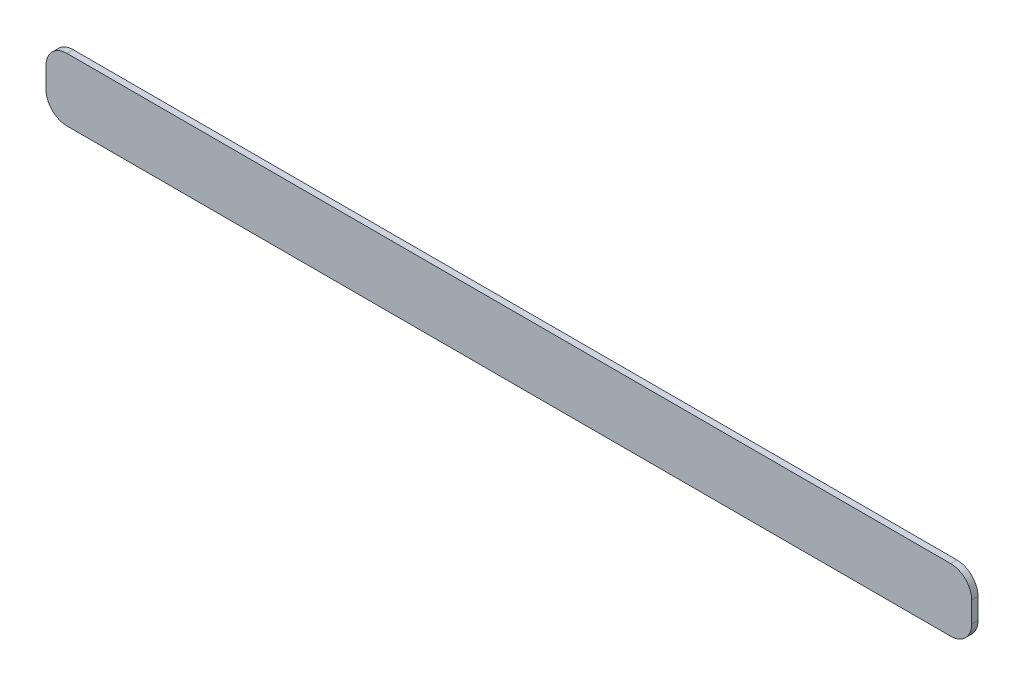
ISO-10303-21;
HEADER;
FILE_DESCRIPTION(('STEP AP214'),'2;1');
FILE_NAME('part.step','',(''),(''),'','','');
FILE_SCHEMA(('AUTOMOTIVE_DESIGN { 1 0 10303 214 1 1 1 1 }'));
ENDSEC;
DATA;
#1=APPLICATION_CONTEXT('core data for automotive mechanical design processes');
#2=APPLICATION_PROTOCOL_DEFINITION('international standard','automotive_design',2000,#1);
#3=PRODUCT_CONTEXT('',#1,'mechanical');
#4=PRODUCT('Part','Part','',(#3));
#5=PRODUCT_RELATED_PRODUCT_CATEGORY('part','',(#4));
#6=PRODUCT_DEFINITION_FORMATION('','',#4);
#7=PRODUCT_DEFINITION_CONTEXT('part definition',#1,'design');
#8=PRODUCT_DEFINITION('design','',#6,#7);
#9=PRODUCT_DEFINITION_SHAPE('','',#8);
#10=(LENGTH_UNIT() NAMED_UNIT(*) SI_UNIT(.MILLI.,.METRE.));
#11=(NAMED_UNIT(*) PLANE_ANGLE_UNIT() SI_UNIT($,.RADIAN.));
#12=(NAMED_UNIT(*) SI_UNIT($,.STERADIAN.) SOLID_ANGLE_UNIT());
#13=UNCERTAINTY_MEASURE_WITH_UNIT(LENGTH_MEASURE(1.E-05),#10,'distance_accuracy_value','');
#14=(GEOMETRIC_REPRESENTATION_CONTEXT(3) GLOBAL_UNCERTAINTY_ASSIGNED_CONTEXT((#13)) GLOBAL_UNIT_ASSIGNED_CONTEXT((#10,
#11,#12)) REPRESENTATION_CONTEXT('',''));
#15=CARTESIAN_POINT('',(0.,0.,0.));
#16=DIRECTION('',(0.,0.,1.));
#17=DIRECTION('',(1.,0.,0.));
#18=AXIS2_PLACEMENT_3D('',#15,#16,#17);
#19=CARTESIAN_POINT('',(429.9,10.,3.));
#20=DIRECTION('',(0.,0.,-1.));
#21=DIRECTION('',(-1.,0.,0.));
#22=AXIS2_PLACEMENT_3D('',#19,#20,#21);
#23=CYLINDRICAL_SURFACE('',#22,10.);
#24=CARTESIAN_POINT('',(429.9,10.,0.));
#25=DIRECTION('',(0.,0.,1.));
#26=DIRECTION('',(1.,0.,0.));
#27=AXIS2_PLACEMENT_3D('',#24,#25,#26);
#28=CIRCLE('',#27,10.);
#29=CARTESIAN_POINT('',(429.9,0.,0.));
#30=VERTEX_POINT('',#29);
#31=CARTESIAN_POINT('',(439.9,10.,0.));
#32=VERTEX_POINT('',#31);
#33=EDGE_CURVE('E140',#30,#32,#28,.T.);
#34=ORIENTED_EDGE('',*,*,#33,.T.);
#35=DIRECTION('',(0.,0.,-1.));
#36=VECTOR('',#35,1.);
#37=CARTESIAN_POINT('',(439.9,10.,3.));
#38=LINE('',#37,#36);
#39=CARTESIAN_POINT('',(439.9,10.,3.));
#40=VERTEX_POINT('',#39);
#41=EDGE_CURVE('E11',#40,#32,#38,.T.);
#42=ORIENTED_EDGE('',*,*,#41,.F.);
#43=CARTESIAN_POINT('',(429.9,10.,3.));
#44=DIRECTION('',(0.,0.,1.));
#45=DIRECTION('',(1.,0.,0.));
#46=AXIS2_PLACEMENT_3D('',#43,#44,#45);
#47=CIRCLE('',#46,10.);
#48=CARTESIAN_POINT('',(429.9,0.,3.));
#49=VERTEX_POINT('',#48);
#50=EDGE_CURVE('E162',#49,#40,#47,.T.);
#51=ORIENTED_EDGE('',*,*,#50,.F.);
#52=DIRECTION('',(0.,0.,-1.));
#53=VECTOR('',#52,1.);
#54=CARTESIAN_POINT('',(429.9,0.,3.));
#55=LINE('',#54,#53);
#56=EDGE_CURVE('E136',#49,#30,#55,.T.);
#57=ORIENTED_EDGE('',*,*,#56,.T.);
#58=EDGE_LOOP('',(#34,#42,#51,#57));
#59=FACE_BOUND('',#58,.T.);
#60=ADVANCED_FACE('F39',(#59),#23,.T.);
#61=CARTESIAN_POINT('',(439.9,10.,3.));
#62=DIRECTION('',(-1.,0.,0.));
#63=DIRECTION('',(0.,0.,1.));
#64=AXIS2_PLACEMENT_3D('',#61,#62,#63);
#65=PLANE('',#64);
#66=DIRECTION('',(0.,1.,0.));
#67=VECTOR('',#66,1.);
#68=CARTESIAN_POINT('',(439.9,10.,0.));
#69=LINE('',#68,#67);
#70=CARTESIAN_POINT('',(439.9,19.9,0.));
#71=VERTEX_POINT('',#70);
#72=EDGE_CURVE('E144',#32,#71,#69,.T.);
#73=ORIENTED_EDGE('',*,*,#72,.T.);
#74=DIRECTION('',(0.,0.,-1.));
#75=VECTOR('',#74,1.);
#76=CARTESIAN_POINT('',(439.9,19.9,3.));
#77=LINE('',#76,#75);
#78=CARTESIAN_POINT('',(439.9,19.9,3.));
#79=VERTEX_POINT('',#78);
#80=EDGE_CURVE('E48',#79,#71,#77,.T.);
#81=ORIENTED_EDGE('',*,*,#80,.F.);
#82=DIRECTION('',(0.,1.,0.));
#83=VECTOR('',#82,1.);
#84=CARTESIAN_POINT('',(439.9,10.,3.));
#85=LINE('',#84,#83);
#86=EDGE_CURVE('E99',#40,#79,#85,.T.);
#87=ORIENTED_EDGE('',*,*,#86,.F.);
#88=ORIENTED_EDGE('',*,*,#41,.T.);
#89=EDGE_LOOP('',(#73,#81,#87,#88));
#90=FACE_BOUND('',#89,.T.);
#91=ADVANCED_FACE('F208',(#90),#65,.F.);
#92=CARTESIAN_POINT('',(429.9,19.9,3.));
#93=DIRECTION('',(0.,0.,-1.));
#94=DIRECTION('',(-1.,0.,0.));
#95=AXIS2_PLACEMENT_3D('',#92,#93,#94);
#96=CYLINDRICAL_SURFACE('',#95,10.);
#97=CARTESIAN_POINT('',(429.9,19.9,0.));
#98=DIRECTION('',(0.,0.,1.));
#99=DIRECTION('',(1.,0.,0.));
#100=AXIS2_PLACEMENT_3D('',#97,#98,#99);
#101=CIRCLE('',#100,10.);
#102=CARTESIAN_POINT('',(429.9,29.9,0.));
#103=VERTEX_POINT('',#102);
#104=EDGE_CURVE('E147',#71,#103,#101,.T.);
#105=ORIENTED_EDGE('',*,*,#104,.T.);
#106=DIRECTION('',(0.,0.,-1.));
#107=VECTOR('',#106,1.);
#108=CARTESIAN_POINT('',(429.9,29.9,3.));
#109=LINE('',#108,#107);
#110=CARTESIAN_POINT('',(429.9,29.9,3.));
#111=VERTEX_POINT('',#110);
#112=EDGE_CURVE('E173',#111,#103,#109,.T.);
#113=ORIENTED_EDGE('',*,*,#112,.F.);
#114=CARTESIAN_POINT('',(429.9,19.9,3.));
#115=DIRECTION('',(0.,0.,1.));
#116=DIRECTION('',(1.,0.,0.));
#117=AXIS2_PLACEMENT_3D('',#114,#115,#116);
#118=CIRCLE('',#117,10.);
#119=EDGE_CURVE('E183',#79,#111,#118,.T.);
#120=ORIENTED_EDGE('',*,*,#119,.F.);
#121=ORIENTED_EDGE('',*,*,#80,.T.);
#122=EDGE_LOOP('',(#105,#113,#120,#121));
#123=FACE_BOUND('',#122,.T.);
#124=ADVANCED_FACE('F181',(#123),#96,.T.);
#125=CARTESIAN_POINT('',(10.,29.9,3.));
#126=DIRECTION('',(0.,-1.,0.));
#127=DIRECTION('',(0.,0.,-1.));
#128=AXIS2_PLACEMENT_3D('',#125,#126,#127);
#129=PLANE('',#128);
#130=DIRECTION('',(-1.,0.,0.));
#131=VECTOR('',#130,1.);
#132=CARTESIAN_POINT('',(10.,29.9,0.));
#133=LINE('',#132,#131);
#134=CARTESIAN_POINT('',(10.,29.9,0.));
#135=VERTEX_POINT('',#134);
#136=EDGE_CURVE('E150',#103,#135,#133,.T.);
#137=ORIENTED_EDGE('',*,*,#136,.T.);
#138=DIRECTION('',(0.,0.,-1.));
#139=VECTOR('',#138,1.);
#140=CARTESIAN_POINT('',(10.,29.9,3.));
#141=LINE('',#140,#139);
#142=CARTESIAN_POINT('',(10.,29.9,3.));
#143=VERTEX_POINT('',#142);
#144=EDGE_CURVE('E169',#143,#135,#141,.T.);
#145=ORIENTED_EDGE('',*,*,#144,.F.);
#146=DIRECTION('',(-1.,0.,0.));
#147=VECTOR('',#146,1.);
#148=CARTESIAN_POINT('',(10.,29.9,3.));
#149=LINE('',#148,#147);
#150=EDGE_CURVE('E196',#111,#143,#149,.T.);
#151=ORIENTED_EDGE('',*,*,#150,.F.);
#152=ORIENTED_EDGE('',*,*,#112,.T.);
#153=EDGE_LOOP('',(#137,#145,#151,#152));
#154=FACE_BOUND('',#153,.T.);
#155=ADVANCED_FACE('F191',(#154),#129,.F.);
#156=CARTESIAN_POINT('',(10.,19.9,3.));
#157=DIRECTION('',(0.,0.,-1.));
#158=DIRECTION('',(-1.,0.,0.));
#159=AXIS2_PLACEMENT_3D('',#156,#157,#158);
#160=CYLINDRICAL_SURFACE('',#159,10.);
#161=CARTESIAN_POINT('',(10.,19.9,0.));
#162=DIRECTION('',(0.,0.,1.));
#163=DIRECTION('',(-1.,0.,0.));
#164=AXIS2_PLACEMENT_3D('',#161,#162,#163);
#165=CIRCLE('',#164,10.);
#166=CARTESIAN_POINT('',(0.,19.9,0.));
#167=VERTEX_POINT('',#166);
#168=EDGE_CURVE('E153',#135,#167,#165,.T.);
#169=ORIENTED_EDGE('',*,*,#168,.T.);
#170=DIRECTION('',(0.,0.,-1.));
#171=VECTOR('',#170,1.);
#172=CARTESIAN_POINT('',(0.,19.9,3.));
#173=LINE('',#172,#171);
#174=CARTESIAN_POINT('',(0.,19.9,3.));
#175=VERTEX_POINT('',#174);
#176=EDGE_CURVE('E129',#175,#167,#173,.T.);
#177=ORIENTED_EDGE('',*,*,#176,.F.);
#178=CARTESIAN_POINT('',(10.,19.9,3.));
#179=DIRECTION('',(0.,0.,1.));
#180=DIRECTION('',(-1.,0.,0.));
#181=AXIS2_PLACEMENT_3D('',#178,#179,#180);
#182=CIRCLE('',#181,10.);
#183=EDGE_CURVE('E118',#143,#175,#182,.T.);
#184=ORIENTED_EDGE('',*,*,#183,.F.);
#185=ORIENTED_EDGE('',*,*,#144,.T.);
#186=EDGE_LOOP('',(#169,#177,#184,#185));
#187=FACE_BOUND('',#186,.T.);
#188=ADVANCED_FACE('F194',(#187),#160,.T.);
#189=CARTESIAN_POINT('',(0.,10.0000000000001,3.));
#190=DIRECTION('',(1.,0.,0.));
#191=DIRECTION('',(0.,0.,-1.));
#192=AXIS2_PLACEMENT_3D('',#189,#190,#191);
#193=PLANE('',#192);
#194=DIRECTION('',(0.,-1.,0.));
#195=VECTOR('',#194,1.);
#196=CARTESIAN_POINT('',(0.,10.0000000000001,0.));
#197=LINE('',#196,#195);
#198=CARTESIAN_POINT('',(0.,10.0000000000001,0.));
#199=VERTEX_POINT('',#198);
#200=EDGE_CURVE('E127',#167,#199,#197,.T.);
#201=ORIENTED_EDGE('',*,*,#200,.T.);
#202=DIRECTION('',(0.,0.,-1.));
#203=VECTOR('',#202,1.);
#204=CARTESIAN_POINT('',(0.,10.0000000000001,3.));
#205=LINE('',#204,#203);
#206=CARTESIAN_POINT('',(0.,10.0000000000001,3.));
#207=VERTEX_POINT('',#206);
#208=EDGE_CURVE('E124',#207,#199,#205,.T.);
#209=ORIENTED_EDGE('',*,*,#208,.F.);
#210=DIRECTION('',(0.,-1.,0.));
#211=VECTOR('',#210,1.);
#212=CARTESIAN_POINT('',(0.,10.0000000000001,3.));
#213=LINE('',#212,#211);
#214=EDGE_CURVE('E112',#175,#207,#213,.T.);
#215=ORIENTED_EDGE('',*,*,#214,.F.);
#216=ORIENTED_EDGE('',*,*,#176,.T.);
#217=EDGE_LOOP('',(#201,#209,#215,#216));
#218=FACE_BOUND('',#217,.T.);
#219=ADVANCED_FACE('F125',(#218),#193,.F.);
#220=CARTESIAN_POINT('',(10.,10.,3.));
#221=DIRECTION('',(0.,0.,-1.));
#222=DIRECTION('',(-1.,0.,0.));
#223=AXIS2_PLACEMENT_3D('',#220,#221,#222);
#224=CYLINDRICAL_SURFACE('',#223,10.);
#225=CARTESIAN_POINT('',(10.,10.,0.));
#226=DIRECTION('',(0.,0.,1.));
#227=DIRECTION('',(1.,0.,0.));
#228=AXIS2_PLACEMENT_3D('',#225,#226,#227);
#229=CIRCLE('',#228,10.);
#230=CARTESIAN_POINT('',(10.0000000000001,0.,0.));
#231=VERTEX_POINT('',#230);
#232=EDGE_CURVE('E85',#199,#231,#229,.T.);
#233=ORIENTED_EDGE('',*,*,#232,.T.);
#234=DIRECTION('',(0.,0.,-1.));
#235=VECTOR('',#234,1.);
#236=CARTESIAN_POINT('',(10.0000000000001,0.,3.));
#237=LINE('',#236,#235);
#238=CARTESIAN_POINT('',(10.0000000000001,0.,3.));
#239=VERTEX_POINT('',#238);
#240=EDGE_CURVE('E130',#239,#231,#237,.T.);
#241=ORIENTED_EDGE('',*,*,#240,.F.);
#242=CARTESIAN_POINT('',(10.,10.,3.));
#243=DIRECTION('',(0.,0.,1.));
#244=DIRECTION('',(1.,0.,0.));
#245=AXIS2_PLACEMENT_3D('',#242,#243,#244);
#246=CIRCLE('',#245,10.);
#247=EDGE_CURVE('E116',#207,#239,#246,.T.);
#248=ORIENTED_EDGE('',*,*,#247,.F.);
#249=ORIENTED_EDGE('',*,*,#208,.T.);
#250=EDGE_LOOP('',(#233,#241,#248,#249));
#251=FACE_BOUND('',#250,.T.);
#252=ADVANCED_FACE('F132',(#251),#224,.T.);
#253=CARTESIAN_POINT('',(10.0000000000001,0.,3.));
#254=DIRECTION('',(0.,1.,0.));
#255=DIRECTION('',(0.,0.,1.));
#256=AXIS2_PLACEMENT_3D('',#253,#254,#255);
#257=PLANE('',#256);
#258=DIRECTION('',(1.,0.,0.));
#259=VECTOR('',#258,1.);
#260=CARTESIAN_POINT('',(10.0000000000001,0.,0.));
#261=LINE('',#260,#259);
#262=EDGE_CURVE('E91',#231,#30,#261,.T.);
#263=ORIENTED_EDGE('',*,*,#262,.T.);
#264=ORIENTED_EDGE('',*,*,#56,.F.);
#265=DIRECTION('',(1.,0.,0.));
#266=VECTOR('',#265,1.);
#267=CARTESIAN_POINT('',(10.0000000000001,0.,3.));
#268=LINE('',#267,#266);
#269=EDGE_CURVE('E56',#239,#49,#268,.T.);
#270=ORIENTED_EDGE('',*,*,#269,.F.);
#271=ORIENTED_EDGE('',*,*,#240,.T.);
#272=EDGE_LOOP('',(#263,#264,#270,#271));
#273=FACE_BOUND('',#272,.T.);
#274=ADVANCED_FACE('F224',(#273),#257,.F.);
#275=CARTESIAN_POINT('',(429.9,10.,3.));
#276=DIRECTION('',(0.,0.,1.));
#277=DIRECTION('',(1.,0.,0.));
#278=AXIS2_PLACEMENT_3D('',#275,#276,#277);
#279=PLANE('',#278);
#280=ORIENTED_EDGE('',*,*,#50,.T.);
#281=ORIENTED_EDGE('',*,*,#86,.T.);
#282=ORIENTED_EDGE('',*,*,#119,.T.);
#283=ORIENTED_EDGE('',*,*,#150,.T.);
#284=ORIENTED_EDGE('',*,*,#183,.T.);
#285=ORIENTED_EDGE('',*,*,#214,.T.);
#286=ORIENTED_EDGE('',*,*,#247,.T.);
#287=ORIENTED_EDGE('',*,*,#269,.T.);
#288=EDGE_LOOP('',(#280,#281,#282,#283,#284,#285,#286,#287));
#289=FACE_BOUND('',#288,.T.);
#290=ADVANCED_FACE('F114',(#289),#279,.T.);
#291=CARTESIAN_POINT('',(429.9,10.,0.));
#292=DIRECTION('',(0.,0.,1.));
#293=DIRECTION('',(1.,0.,0.));
#294=AXIS2_PLACEMENT_3D('',#291,#292,#293);
#295=PLANE('',#294);
#296=ORIENTED_EDGE('',*,*,#33,.F.);
#297=ORIENTED_EDGE('',*,*,#262,.F.);
#298=ORIENTED_EDGE('',*,*,#232,.F.);
#299=ORIENTED_EDGE('',*,*,#200,.F.);
#300=ORIENTED_EDGE('',*,*,#168,.F.);
#301=ORIENTED_EDGE('',*,*,#136,.F.);
#302=ORIENTED_EDGE('',*,*,#104,.F.);
#303=ORIENTED_EDGE('',*,*,#72,.F.);
#304=EDGE_LOOP('',(#296,#297,#298,#299,#300,#301,#302,#303));
#305=FACE_BOUND('',#304,.T.);
#306=ADVANCED_FACE('F187',(#305),#295,.F.);
#307=CLOSED_SHELL('',(#60,#91,#124,#155,#188,#219,#252,#274,#290,#306));
#308=MANIFOLD_SOLID_BREP('B2',#307);
#309=ADVANCED_BREP_SHAPE_REPRESENTATION('',(#18,#308),#14);
#310=SHAPE_DEFINITION_REPRESENTATION(#9,#309);
ENDSEC;
END-ISO-10303-21;
